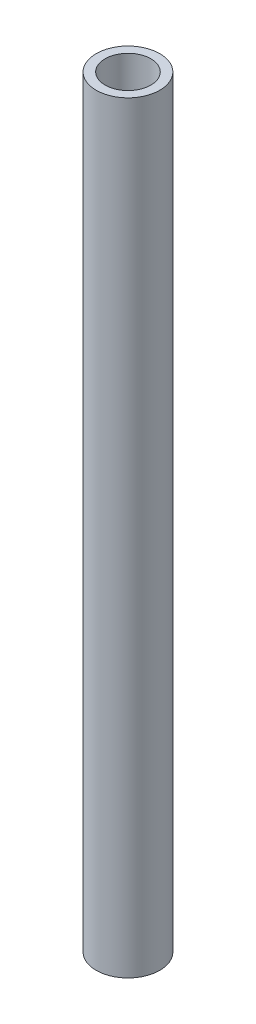
ISO-10303-21;
HEADER;
FILE_DESCRIPTION(('STEP AP214'),'2;1');
FILE_NAME('part.step','',(''),(''),'','','');
FILE_SCHEMA(('AUTOMOTIVE_DESIGN { 1 0 10303 214 1 1 1 1 }'));
ENDSEC;
DATA;
#1=APPLICATION_CONTEXT('core data for automotive mechanical design processes');
#2=APPLICATION_PROTOCOL_DEFINITION('international standard','automotive_design',2000,#1);
#3=PRODUCT_CONTEXT('',#1,'mechanical');
#4=PRODUCT('Part','Part','',(#3));
#5=PRODUCT_RELATED_PRODUCT_CATEGORY('part','',(#4));
#6=PRODUCT_DEFINITION_FORMATION('','',#4);
#7=PRODUCT_DEFINITION_CONTEXT('part definition',#1,'design');
#8=PRODUCT_DEFINITION('design','',#6,#7);
#9=PRODUCT_DEFINITION_SHAPE('','',#8);
#10=(LENGTH_UNIT() NAMED_UNIT(*) SI_UNIT(.MILLI.,.METRE.));
#11=(NAMED_UNIT(*) PLANE_ANGLE_UNIT() SI_UNIT($,.RADIAN.));
#12=(NAMED_UNIT(*) SI_UNIT($,.STERADIAN.) SOLID_ANGLE_UNIT());
#13=UNCERTAINTY_MEASURE_WITH_UNIT(LENGTH_MEASURE(1.E-05),#10,'distance_accuracy_value','');
#14=(GEOMETRIC_REPRESENTATION_CONTEXT(3) GLOBAL_UNCERTAINTY_ASSIGNED_CONTEXT((#13)) GLOBAL_UNIT_ASSIGNED_CONTEXT((#10,
#11,#12)) REPRESENTATION_CONTEXT('',''));
#15=CARTESIAN_POINT('',(0.,0.,0.));
#16=DIRECTION('',(0.,0.,1.));
#17=DIRECTION('',(1.,0.,0.));
#18=AXIS2_PLACEMENT_3D('',#15,#16,#17);
#19=CARTESIAN_POINT('',(0.,76.2,0.));
#20=DIRECTION('',(0.,1.,0.));
#21=DIRECTION('',(0.,0.,1.));
#22=AXIS2_PLACEMENT_3D('',#19,#20,#21);
#23=PLANE('',#22);
#24=CARTESIAN_POINT('',(0.,76.2,0.));
#25=DIRECTION('',(0.,1.,0.));
#26=DIRECTION('',(0.,0.,1.));
#27=AXIS2_PLACEMENT_3D('',#24,#25,#26);
#28=CIRCLE('',#27,3.175);
#29=CARTESIAN_POINT('',(0.,76.2,3.175));
#30=VERTEX_POINT('',#29);
#31=EDGE_CURVE('E10',#30,#30,#28,.T.);
#32=ORIENTED_EDGE('',*,*,#31,.T.);
#33=EDGE_LOOP('',(#32));
#34=FACE_BOUND('',#33,.T.);
#35=CARTESIAN_POINT('',(0.,76.2,0.));
#36=DIRECTION('',(0.,1.,0.));
#37=DIRECTION('',(0.,0.,1.));
#38=AXIS2_PLACEMENT_3D('',#35,#36,#37);
#39=CIRCLE('',#38,2.286);
#40=CARTESIAN_POINT('',(0.,76.2,2.286));
#41=VERTEX_POINT('',#40);
#42=EDGE_CURVE('E43',#41,#41,#39,.T.);
#43=ORIENTED_EDGE('',*,*,#42,.F.);
#44=EDGE_LOOP('',(#43));
#45=FACE_BOUND('',#44,.T.);
#46=ADVANCED_FACE('F32',(#34,#45),#23,.T.);
#47=CARTESIAN_POINT('',(0.,0.,0.));
#48=DIRECTION('',(0.,1.,0.));
#49=DIRECTION('',(0.,0.,1.));
#50=AXIS2_PLACEMENT_3D('',#47,#48,#49);
#51=PLANE('',#50);
#52=CARTESIAN_POINT('',(0.,0.,0.));
#53=DIRECTION('',(0.,1.,0.));
#54=DIRECTION('',(0.,0.,1.));
#55=AXIS2_PLACEMENT_3D('',#52,#53,#54);
#56=CIRCLE('',#55,3.175);
#57=CARTESIAN_POINT('',(0.,0.,3.175));
#58=VERTEX_POINT('',#57);
#59=EDGE_CURVE('E36',#58,#58,#56,.T.);
#60=ORIENTED_EDGE('',*,*,#59,.F.);
#61=EDGE_LOOP('',(#60));
#62=FACE_BOUND('',#61,.T.);
#63=CARTESIAN_POINT('',(0.,0.,0.));
#64=DIRECTION('',(0.,1.,0.));
#65=DIRECTION('',(0.,0.,1.));
#66=AXIS2_PLACEMENT_3D('',#63,#64,#65);
#67=CIRCLE('',#66,2.286);
#68=CARTESIAN_POINT('',(0.,0.,2.286));
#69=VERTEX_POINT('',#68);
#70=EDGE_CURVE('E45',#69,#69,#67,.T.);
#71=ORIENTED_EDGE('',*,*,#70,.T.);
#72=EDGE_LOOP('',(#71));
#73=FACE_BOUND('',#72,.T.);
#74=ADVANCED_FACE('F55',(#62,#73),#51,.F.);
#75=CARTESIAN_POINT('',(0.,76.2,0.));
#76=DIRECTION('',(0.,-1.,0.));
#77=DIRECTION('',(0.,0.,-1.));
#78=AXIS2_PLACEMENT_3D('',#75,#76,#77);
#79=CYLINDRICAL_SURFACE('',#78,3.175);
#80=ORIENTED_EDGE('',*,*,#31,.F.);
#81=EDGE_LOOP('',(#80));
#82=FACE_BOUND('',#81,.T.);
#83=ORIENTED_EDGE('',*,*,#59,.T.);
#84=EDGE_LOOP('',(#83));
#85=FACE_BOUND('',#84,.T.);
#86=ADVANCED_FACE('F34',(#82,#85),#79,.T.);
#87=CARTESIAN_POINT('',(0.,76.2,0.));
#88=DIRECTION('',(0.,-1.,0.));
#89=DIRECTION('',(0.,0.,-1.));
#90=AXIS2_PLACEMENT_3D('',#87,#88,#89);
#91=CYLINDRICAL_SURFACE('',#90,2.286);
#92=ORIENTED_EDGE('',*,*,#42,.T.);
#93=EDGE_LOOP('',(#92));
#94=FACE_BOUND('',#93,.T.);
#95=ORIENTED_EDGE('',*,*,#70,.F.);
#96=EDGE_LOOP('',(#95));
#97=FACE_BOUND('',#96,.T.);
#98=ADVANCED_FACE('F51',(#94,#97),#91,.F.);
#99=CLOSED_SHELL('',(#46,#74,#86,#98));
#100=MANIFOLD_SOLID_BREP('B2',#99);
#101=ADVANCED_BREP_SHAPE_REPRESENTATION('',(#18,#100),#14);
#102=SHAPE_DEFINITION_REPRESENTATION(#9,#101);
ENDSEC;
END-ISO-10303-21;
